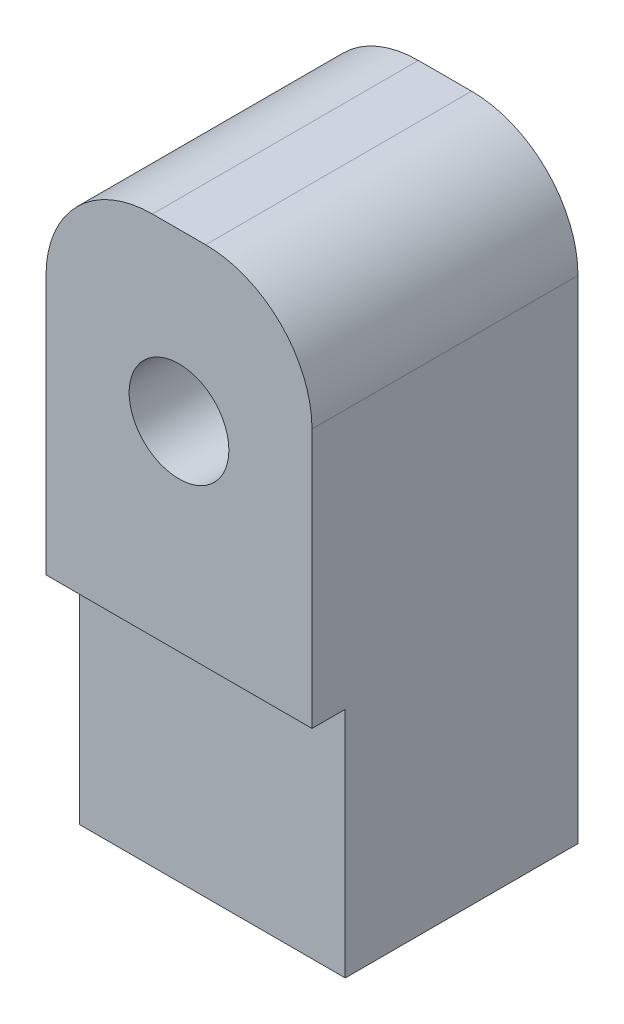
ISO-10303-21;
HEADER;
FILE_DESCRIPTION(('STEP AP214'),'2;1');
FILE_NAME('part.step','',(''),(''),'','','');
FILE_SCHEMA(('AUTOMOTIVE_DESIGN { 1 0 10303 214 1 1 1 1 }'));
ENDSEC;
DATA;
#1=APPLICATION_CONTEXT('core data for automotive mechanical design processes');
#2=APPLICATION_PROTOCOL_DEFINITION('international standard','automotive_design',2000,#1);
#3=PRODUCT_CONTEXT('',#1,'mechanical');
#4=PRODUCT('Part','Part','',(#3));
#5=PRODUCT_RELATED_PRODUCT_CATEGORY('part','',(#4));
#6=PRODUCT_DEFINITION_FORMATION('','',#4);
#7=PRODUCT_DEFINITION_CONTEXT('part definition',#1,'design');
#8=PRODUCT_DEFINITION('design','',#6,#7);
#9=PRODUCT_DEFINITION_SHAPE('','',#8);
#10=(LENGTH_UNIT() NAMED_UNIT(*) SI_UNIT(.MILLI.,.METRE.));
#11=(NAMED_UNIT(*) PLANE_ANGLE_UNIT() SI_UNIT($,.RADIAN.));
#12=(NAMED_UNIT(*) SI_UNIT($,.STERADIAN.) SOLID_ANGLE_UNIT());
#13=UNCERTAINTY_MEASURE_WITH_UNIT(LENGTH_MEASURE(1.E-05),#10,'distance_accuracy_value','');
#14=(GEOMETRIC_REPRESENTATION_CONTEXT(3) GLOBAL_UNCERTAINTY_ASSIGNED_CONTEXT((#13)) GLOBAL_UNIT_ASSIGNED_CONTEXT((#10,
#11,#12)) REPRESENTATION_CONTEXT('',''));
#15=CARTESIAN_POINT('',(0.,0.,0.));
#16=DIRECTION('',(0.,0.,1.));
#17=DIRECTION('',(1.,0.,0.));
#18=AXIS2_PLACEMENT_3D('',#15,#16,#17);
#19=CARTESIAN_POINT('',(-5.,0.,8.75));
#20=DIRECTION('',(1.,0.,0.));
#21=DIRECTION('',(0.,1.,0.));
#22=AXIS2_PLACEMENT_3D('',#19,#20,#21);
#23=PLANE('',#22);
#24=DIRECTION('',(0.,-1.,0.));
#25=VECTOR('',#24,1.);
#26=CARTESIAN_POINT('',(-5.00000000000001,11.25,10.));
#27=LINE('',#26,#25);
#28=CARTESIAN_POINT('',(-5.00000000000001,7.25,10.));
#29=VERTEX_POINT('',#28);
#30=CARTESIAN_POINT('',(-5.,-2.5,10.));
#31=VERTEX_POINT('',#30);
#32=EDGE_CURVE('E106',#29,#31,#27,.T.);
#33=ORIENTED_EDGE('',*,*,#32,.F.);
#34=DIRECTION('',(0.,0.,1.));
#35=VECTOR('',#34,1.);
#36=CARTESIAN_POINT('',(-5.,7.25,8.75));
#37=LINE('',#36,#35);
#38=CARTESIAN_POINT('',(-5.,7.25,0.));
#39=VERTEX_POINT('',#38);
#40=EDGE_CURVE('E65',#29,#39,#37,.F.);
#41=ORIENTED_EDGE('',*,*,#40,.T.);
#42=DIRECTION('',(0.,-1.,0.));
#43=VECTOR('',#42,1.);
#44=CARTESIAN_POINT('',(-5.,0.,0.));
#45=LINE('',#44,#43);
#46=CARTESIAN_POINT('',(-5.,-11.25,0.));
#47=VERTEX_POINT('',#46);
#48=EDGE_CURVE('E116',#39,#47,#45,.T.);
#49=ORIENTED_EDGE('',*,*,#48,.T.);
#50=DIRECTION('',(0.,0.,-1.));
#51=VECTOR('',#50,1.);
#52=CARTESIAN_POINT('',(-5.,-11.25,8.75));
#53=LINE('',#52,#51);
#54=CARTESIAN_POINT('',(-5.,-11.25,8.75));
#55=VERTEX_POINT('',#54);
#56=EDGE_CURVE('E167',#55,#47,#53,.T.);
#57=ORIENTED_EDGE('',*,*,#56,.F.);
#58=DIRECTION('',(0.,-1.,0.));
#59=VECTOR('',#58,1.);
#60=CARTESIAN_POINT('',(-5.,0.,8.75));
#61=LINE('',#60,#59);
#62=CARTESIAN_POINT('',(-5.,-2.5,8.75));
#63=VERTEX_POINT('',#62);
#64=EDGE_CURVE('E122',#63,#55,#61,.T.);
#65=ORIENTED_EDGE('',*,*,#64,.F.);
#66=DIRECTION('',(0.,0.,1.));
#67=VECTOR('',#66,1.);
#68=CARTESIAN_POINT('',(-5.,-2.5,10.));
#69=LINE('',#68,#67);
#70=EDGE_CURVE('E120',#63,#31,#69,.T.);
#71=ORIENTED_EDGE('',*,*,#70,.T.);
#72=EDGE_LOOP('',(#33,#41,#49,#57,#65,#71));
#73=FACE_BOUND('',#72,.T.);
#74=ADVANCED_FACE('F41',(#73),#23,.F.);
#75=CARTESIAN_POINT('',(0.,-11.25,8.75));
#76=DIRECTION('',(0.,1.,0.));
#77=DIRECTION('',(0.,0.,1.));
#78=AXIS2_PLACEMENT_3D('',#75,#76,#77);
#79=PLANE('',#78);
#80=CARTESIAN_POINT('',(0.,-11.25,5.));
#81=DIRECTION('',(0.,-1.,0.));
#82=DIRECTION('',(0.,0.,-1.));
#83=AXIS2_PLACEMENT_3D('',#80,#81,#82);
#84=CIRCLE('',#83,2.5);
#85=CARTESIAN_POINT('',(0.,-11.25,2.5));
#86=VERTEX_POINT('',#85);
#87=EDGE_CURVE('E264',#86,#86,#84,.T.);
#88=ORIENTED_EDGE('',*,*,#87,.F.);
#89=EDGE_LOOP('',(#88));
#90=FACE_BOUND('',#89,.T.);
#91=DIRECTION('',(1.,0.,0.));
#92=VECTOR('',#91,1.);
#93=CARTESIAN_POINT('',(0.,-11.25,0.));
#94=LINE('',#93,#92);
#95=CARTESIAN_POINT('',(5.,-11.25,0.));
#96=VERTEX_POINT('',#95);
#97=EDGE_CURVE('E158',#47,#96,#94,.T.);
#98=ORIENTED_EDGE('',*,*,#97,.T.);
#99=DIRECTION('',(0.,0.,-1.));
#100=VECTOR('',#99,1.);
#101=CARTESIAN_POINT('',(5.,-11.25,8.75));
#102=LINE('',#101,#100);
#103=CARTESIAN_POINT('',(5.,-11.25,8.75));
#104=VERTEX_POINT('',#103);
#105=EDGE_CURVE('E155',#104,#96,#102,.T.);
#106=ORIENTED_EDGE('',*,*,#105,.F.);
#107=DIRECTION('',(1.,0.,0.));
#108=VECTOR('',#107,1.);
#109=CARTESIAN_POINT('',(0.,-11.25,8.75));
#110=LINE('',#109,#108);
#111=EDGE_CURVE('E148',#55,#104,#110,.T.);
#112=ORIENTED_EDGE('',*,*,#111,.F.);
#113=ORIENTED_EDGE('',*,*,#56,.T.);
#114=EDGE_LOOP('',(#98,#106,#112,#113));
#115=FACE_BOUND('',#114,.T.);
#116=ADVANCED_FACE('F208',(#90,#115),#79,.F.);
#117=CARTESIAN_POINT('',(5.,0.,8.75));
#118=DIRECTION('',(1.,0.,0.));
#119=DIRECTION('',(0.,1.,0.));
#120=AXIS2_PLACEMENT_3D('',#117,#118,#119);
#121=PLANE('',#120);
#122=DIRECTION('',(0.,-1.,0.));
#123=VECTOR('',#122,1.);
#124=CARTESIAN_POINT('',(5.,0.,0.));
#125=LINE('',#124,#123);
#126=CARTESIAN_POINT('',(5.,7.25,0.));
#127=VERTEX_POINT('',#126);
#128=EDGE_CURVE('E145',#127,#96,#125,.T.);
#129=ORIENTED_EDGE('',*,*,#128,.F.);
#130=DIRECTION('',(0.,0.,-1.));
#131=VECTOR('',#130,1.);
#132=CARTESIAN_POINT('',(5.,7.25,10.));
#133=LINE('',#132,#131);
#134=CARTESIAN_POINT('',(4.99999999999999,7.25,10.));
#135=VERTEX_POINT('',#134);
#136=EDGE_CURVE('E11',#127,#135,#133,.F.);
#137=ORIENTED_EDGE('',*,*,#136,.T.);
#138=DIRECTION('',(0.,-1.,0.));
#139=VECTOR('',#138,1.);
#140=CARTESIAN_POINT('',(4.99999999999999,11.25,10.));
#141=LINE('',#140,#139);
#142=CARTESIAN_POINT('',(5.,-2.5,10.));
#143=VERTEX_POINT('',#142);
#144=EDGE_CURVE('E117',#135,#143,#141,.T.);
#145=ORIENTED_EDGE('',*,*,#144,.T.);
#146=DIRECTION('',(0.,0.,-1.));
#147=VECTOR('',#146,1.);
#148=CARTESIAN_POINT('',(5.,-2.5,10.));
#149=LINE('',#148,#147);
#150=CARTESIAN_POINT('',(5.,-2.5,8.75));
#151=VERTEX_POINT('',#150);
#152=EDGE_CURVE('E127',#143,#151,#149,.T.);
#153=ORIENTED_EDGE('',*,*,#152,.T.);
#154=DIRECTION('',(0.,-1.,0.));
#155=VECTOR('',#154,1.);
#156=CARTESIAN_POINT('',(5.,0.,8.75));
#157=LINE('',#156,#155);
#158=EDGE_CURVE('E151',#151,#104,#157,.T.);
#159=ORIENTED_EDGE('',*,*,#158,.T.);
#160=ORIENTED_EDGE('',*,*,#105,.T.);
#161=EDGE_LOOP('',(#129,#137,#145,#153,#159,#160));
#162=FACE_BOUND('',#161,.T.);
#163=ADVANCED_FACE('F212',(#162),#121,.T.);
#164=CARTESIAN_POINT('',(0.,0.,8.75));
#165=DIRECTION('',(0.,0.,1.));
#166=DIRECTION('',(1.,0.,0.));
#167=AXIS2_PLACEMENT_3D('',#164,#165,#166);
#168=PLANE('',#167);
#169=DIRECTION('',(1.,0.,0.));
#170=VECTOR('',#169,1.);
#171=CARTESIAN_POINT('',(0.,-2.5,8.75));
#172=LINE('',#171,#170);
#173=EDGE_CURVE('E142',#63,#151,#172,.T.);
#174=ORIENTED_EDGE('',*,*,#173,.F.);
#175=ORIENTED_EDGE('',*,*,#64,.T.);
#176=ORIENTED_EDGE('',*,*,#111,.T.);
#177=ORIENTED_EDGE('',*,*,#158,.F.);
#178=EDGE_LOOP('',(#174,#175,#176,#177));
#179=FACE_BOUND('',#178,.T.);
#180=ADVANCED_FACE('F218',(#179),#168,.T.);
#181=CARTESIAN_POINT('',(0.,0.,0.));
#182=DIRECTION('',(0.,0.,1.));
#183=DIRECTION('',(1.,0.,0.));
#184=AXIS2_PLACEMENT_3D('',#181,#182,#183);
#185=PLANE('',#184);
#186=CARTESIAN_POINT('',(0.,5.,0.));
#187=DIRECTION('',(0.,0.,-1.));
#188=DIRECTION('',(-1.,0.,0.));
#189=AXIS2_PLACEMENT_3D('',#186,#187,#188);
#190=CIRCLE('',#189,2.375);
#191=CARTESIAN_POINT('',(-2.375,5.,0.));
#192=VERTEX_POINT('',#191);
#193=EDGE_CURVE('E266',#192,#192,#190,.T.);
#194=ORIENTED_EDGE('',*,*,#193,.F.);
#195=EDGE_LOOP('',(#194));
#196=FACE_BOUND('',#195,.T.);
#197=ORIENTED_EDGE('',*,*,#48,.F.);
#198=CARTESIAN_POINT('',(-1.,7.25,0.));
#199=DIRECTION('',(0.,0.,1.));
#200=DIRECTION('',(1.,0.,0.));
#201=AXIS2_PLACEMENT_3D('',#198,#199,#200);
#202=CIRCLE('',#201,4.);
#203=CARTESIAN_POINT('',(-1.,11.25,0.));
#204=VERTEX_POINT('',#203);
#205=EDGE_CURVE('E50',#39,#204,#202,.F.);
#206=ORIENTED_EDGE('',*,*,#205,.T.);
#207=DIRECTION('',(-1.,0.,0.));
#208=VECTOR('',#207,1.);
#209=CARTESIAN_POINT('',(-5.00000000000001,11.25,0.));
#210=LINE('',#209,#208);
#211=CARTESIAN_POINT('',(0.999999999999998,11.25,0.));
#212=VERTEX_POINT('',#211);
#213=EDGE_CURVE('E132',#212,#204,#210,.T.);
#214=ORIENTED_EDGE('',*,*,#213,.F.);
#215=CARTESIAN_POINT('',(0.999999999999999,7.25,0.));
#216=DIRECTION('',(0.,0.,1.));
#217=DIRECTION('',(1.,0.,0.));
#218=AXIS2_PLACEMENT_3D('',#215,#216,#217);
#219=CIRCLE('',#218,4.);
#220=EDGE_CURVE('E57',#212,#127,#219,.F.);
#221=ORIENTED_EDGE('',*,*,#220,.T.);
#222=ORIENTED_EDGE('',*,*,#128,.T.);
#223=ORIENTED_EDGE('',*,*,#97,.F.);
#224=EDGE_LOOP('',(#197,#206,#214,#221,#222,#223));
#225=FACE_BOUND('',#224,.T.);
#226=ADVANCED_FACE('F189',(#196,#225),#185,.F.);
#227=CARTESIAN_POINT('',(-5.00000000000001,11.25,10.));
#228=DIRECTION('',(0.,0.,-1.));
#229=DIRECTION('',(-1.,0.,0.));
#230=AXIS2_PLACEMENT_3D('',#227,#228,#229);
#231=PLANE('',#230);
#232=CARTESIAN_POINT('',(0.,5.,10.));
#233=DIRECTION('',(0.,0.,1.));
#234=DIRECTION('',(1.,0.,0.));
#235=AXIS2_PLACEMENT_3D('',#232,#233,#234);
#236=CIRCLE('',#235,1.875);
#237=CARTESIAN_POINT('',(1.875,5.,10.));
#238=VERTEX_POINT('',#237);
#239=EDGE_CURVE('E259',#238,#238,#236,.T.);
#240=ORIENTED_EDGE('',*,*,#239,.F.);
#241=EDGE_LOOP('',(#240));
#242=FACE_BOUND('',#241,.T.);
#243=DIRECTION('',(1.,0.,0.));
#244=VECTOR('',#243,1.);
#245=CARTESIAN_POINT('',(-5.00000000000001,11.25,10.));
#246=LINE('',#245,#244);
#247=CARTESIAN_POINT('',(-1.,11.25,10.));
#248=VERTEX_POINT('',#247);
#249=CARTESIAN_POINT('',(0.999999999999998,11.25,10.));
#250=VERTEX_POINT('',#249);
#251=EDGE_CURVE('E136',#248,#250,#246,.T.);
#252=ORIENTED_EDGE('',*,*,#251,.F.);
#253=CARTESIAN_POINT('',(-1.,7.25,10.));
#254=DIRECTION('',(0.,0.,-1.));
#255=DIRECTION('',(-1.,0.,0.));
#256=AXIS2_PLACEMENT_3D('',#253,#254,#255);
#257=CIRCLE('',#256,4.);
#258=EDGE_CURVE('E114',#248,#29,#257,.F.);
#259=ORIENTED_EDGE('',*,*,#258,.T.);
#260=ORIENTED_EDGE('',*,*,#32,.T.);
#261=DIRECTION('',(1.,0.,0.));
#262=VECTOR('',#261,1.);
#263=CARTESIAN_POINT('',(-5.,-2.5,10.));
#264=LINE('',#263,#262);
#265=EDGE_CURVE('E112',#31,#143,#264,.T.);
#266=ORIENTED_EDGE('',*,*,#265,.T.);
#267=ORIENTED_EDGE('',*,*,#144,.F.);
#268=CARTESIAN_POINT('',(0.999999999999999,7.25,10.));
#269=DIRECTION('',(0.,0.,-1.));
#270=DIRECTION('',(-1.,0.,0.));
#271=AXIS2_PLACEMENT_3D('',#268,#269,#270);
#272=CIRCLE('',#271,4.);
#273=EDGE_CURVE('E179',#135,#250,#272,.F.);
#274=ORIENTED_EDGE('',*,*,#273,.T.);
#275=EDGE_LOOP('',(#252,#259,#260,#266,#267,#274));
#276=FACE_BOUND('',#275,.T.);
#277=ADVANCED_FACE('F109',(#242,#276),#231,.F.);
#278=CARTESIAN_POINT('',(0.,11.25,0.));
#279=DIRECTION('',(0.,-1.,0.));
#280=DIRECTION('',(1.,0.,0.));
#281=AXIS2_PLACEMENT_3D('',#278,#279,#280);
#282=PLANE('',#281);
#283=ORIENTED_EDGE('',*,*,#213,.T.);
#284=DIRECTION('',(0.,0.,1.));
#285=VECTOR('',#284,1.);
#286=CARTESIAN_POINT('',(-1.,11.25,0.));
#287=LINE('',#286,#285);
#288=EDGE_CURVE('E175',#204,#248,#287,.T.);
#289=ORIENTED_EDGE('',*,*,#288,.T.);
#290=ORIENTED_EDGE('',*,*,#251,.T.);
#291=DIRECTION('',(0.,0.,-1.));
#292=VECTOR('',#291,1.);
#293=CARTESIAN_POINT('',(0.999999999999998,11.25,0.));
#294=LINE('',#293,#292);
#295=EDGE_CURVE('E171',#250,#212,#294,.T.);
#296=ORIENTED_EDGE('',*,*,#295,.T.);
#297=EDGE_LOOP('',(#283,#289,#290,#296));
#298=FACE_BOUND('',#297,.T.);
#299=ADVANCED_FACE('F194',(#298),#282,.F.);
#300=CARTESIAN_POINT('',(0.,-2.5,0.));
#301=DIRECTION('',(0.,-1.,0.));
#302=DIRECTION('',(1.,0.,0.));
#303=AXIS2_PLACEMENT_3D('',#300,#301,#302);
#304=PLANE('',#303);
#305=ORIENTED_EDGE('',*,*,#70,.F.);
#306=ORIENTED_EDGE('',*,*,#173,.T.);
#307=ORIENTED_EDGE('',*,*,#152,.F.);
#308=ORIENTED_EDGE('',*,*,#265,.F.);
#309=EDGE_LOOP('',(#305,#306,#307,#308));
#310=FACE_BOUND('',#309,.T.);
#311=ADVANCED_FACE('F129',(#310),#304,.T.);
#312=CARTESIAN_POINT('',(-1.,7.25,0.));
#313=DIRECTION('',(0.,0.,1.));
#314=DIRECTION('',(1.,0.,0.));
#315=AXIS2_PLACEMENT_3D('',#312,#313,#314);
#316=CYLINDRICAL_SURFACE('',#315,4.);
#317=ORIENTED_EDGE('',*,*,#205,.F.);
#318=ORIENTED_EDGE('',*,*,#40,.F.);
#319=ORIENTED_EDGE('',*,*,#258,.F.);
#320=ORIENTED_EDGE('',*,*,#288,.F.);
#321=EDGE_LOOP('',(#317,#318,#319,#320));
#322=FACE_BOUND('',#321,.T.);
#323=ADVANCED_FACE('F197',(#322),#316,.T.);
#324=CARTESIAN_POINT('',(0.999999999999999,7.25,0.));
#325=DIRECTION('',(0.,0.,1.));
#326=DIRECTION('',(1.,0.,0.));
#327=AXIS2_PLACEMENT_3D('',#324,#325,#326);
#328=CYLINDRICAL_SURFACE('',#327,4.);
#329=ORIENTED_EDGE('',*,*,#273,.F.);
#330=ORIENTED_EDGE('',*,*,#136,.F.);
#331=ORIENTED_EDGE('',*,*,#220,.F.);
#332=ORIENTED_EDGE('',*,*,#295,.F.);
#333=EDGE_LOOP('',(#329,#330,#331,#332));
#334=FACE_BOUND('',#333,.T.);
#335=ADVANCED_FACE('F43',(#334),#328,.T.);
#336=CARTESIAN_POINT('',(0.,0.629999999999997,5.));
#337=DIRECTION('',(0.,-1.,0.));
#338=DIRECTION('',(0.,0.,-1.));
#339=AXIS2_PLACEMENT_3D('',#336,#337,#338);
#340=CYLINDRICAL_SURFACE('',#339,2.5);
#341=CARTESIAN_POINT('',(0.,0.629999999999997,5.));
#342=DIRECTION('',(0.,-1.,0.));
#343=DIRECTION('',(0.,0.,-1.));
#344=AXIS2_PLACEMENT_3D('',#341,#342,#343);
#345=CIRCLE('',#344,2.5);
#346=CARTESIAN_POINT('',(0.,0.629999999999997,2.5));
#347=VERTEX_POINT('',#346);
#348=EDGE_CURVE('E270',#347,#347,#345,.T.);
#349=ORIENTED_EDGE('',*,*,#348,.F.);
#350=EDGE_LOOP('',(#349));
#351=FACE_BOUND('',#350,.T.);
#352=ORIENTED_EDGE('',*,*,#87,.T.);
#353=EDGE_LOOP('',(#352));
#354=FACE_BOUND('',#353,.T.);
#355=ADVANCED_FACE('F203',(#351,#354),#340,.F.);
#356=CARTESIAN_POINT('',(0.,0.629999999999997,5.));
#357=DIRECTION('',(0.,-1.,0.));
#358=DIRECTION('',(0.,0.,-1.));
#359=AXIS2_PLACEMENT_3D('',#356,#357,#358);
#360=PLANE('',#359);
#361=ORIENTED_EDGE('',*,*,#348,.T.);
#362=EDGE_LOOP('',(#361));
#363=FACE_BOUND('',#362,.T.);
#364=ADVANCED_FACE('F233',(#363),#360,.T.);
#365=CARTESIAN_POINT('',(0.,5.,1.25));
#366=DIRECTION('',(0.,0.,1.));
#367=DIRECTION('',(1.,0.,0.));
#368=AXIS2_PLACEMENT_3D('',#365,#366,#367);
#369=CYLINDRICAL_SURFACE('',#368,1.875);
#370=CARTESIAN_POINT('',(0.,5.,1.25));
#371=DIRECTION('',(0.,0.,1.));
#372=DIRECTION('',(1.,0.,0.));
#373=AXIS2_PLACEMENT_3D('',#370,#371,#372);
#374=CIRCLE('',#373,1.875);
#375=CARTESIAN_POINT('',(1.875,5.,1.25));
#376=VERTEX_POINT('',#375);
#377=EDGE_CURVE('E257',#376,#376,#374,.T.);
#378=ORIENTED_EDGE('',*,*,#377,.F.);
#379=EDGE_LOOP('',(#378));
#380=FACE_BOUND('',#379,.T.);
#381=ORIENTED_EDGE('',*,*,#239,.T.);
#382=EDGE_LOOP('',(#381));
#383=FACE_BOUND('',#382,.T.);
#384=ADVANCED_FACE('F237',(#380,#383),#369,.F.);
#385=CARTESIAN_POINT('',(0.,5.,1.25));
#386=DIRECTION('',(0.,0.,-1.));
#387=DIRECTION('',(-1.,0.,0.));
#388=AXIS2_PLACEMENT_3D('',#385,#386,#387);
#389=PLANE('',#388);
#390=CARTESIAN_POINT('',(0.,5.,1.25));
#391=DIRECTION('',(0.,0.,-1.));
#392=DIRECTION('',(-1.,0.,0.));
#393=AXIS2_PLACEMENT_3D('',#390,#391,#392);
#394=CIRCLE('',#393,2.375);
#395=CARTESIAN_POINT('',(-2.375,5.,1.25));
#396=VERTEX_POINT('',#395);
#397=EDGE_CURVE('E254',#396,#396,#394,.T.);
#398=ORIENTED_EDGE('',*,*,#397,.T.);
#399=EDGE_LOOP('',(#398));
#400=FACE_BOUND('',#399,.T.);
#401=ORIENTED_EDGE('',*,*,#377,.T.);
#402=EDGE_LOOP('',(#401));
#403=FACE_BOUND('',#402,.T.);
#404=ADVANCED_FACE('F241',(#400,#403),#389,.T.);
#405=CARTESIAN_POINT('',(0.,5.,1.25));
#406=DIRECTION('',(0.,0.,-1.));
#407=DIRECTION('',(-1.,0.,0.));
#408=AXIS2_PLACEMENT_3D('',#405,#406,#407);
#409=CYLINDRICAL_SURFACE('',#408,2.375);
#410=ORIENTED_EDGE('',*,*,#397,.F.);
#411=EDGE_LOOP('',(#410));
#412=FACE_BOUND('',#411,.T.);
#413=ORIENTED_EDGE('',*,*,#193,.T.);
#414=EDGE_LOOP('',(#413));
#415=FACE_BOUND('',#414,.T.);
#416=ADVANCED_FACE('F243',(#412,#415),#409,.F.);
#417=CLOSED_SHELL('',(#74,#116,#163,#180,#226,#277,#299,#311,#323,#335,#355,#364,#384,#404,#416));
#418=MANIFOLD_SOLID_BREP('B2',#417);
#419=ADVANCED_BREP_SHAPE_REPRESENTATION('',(#18,#418),#14);
#420=SHAPE_DEFINITION_REPRESENTATION(#9,#419);
ENDSEC;
END-ISO-10303-21;
